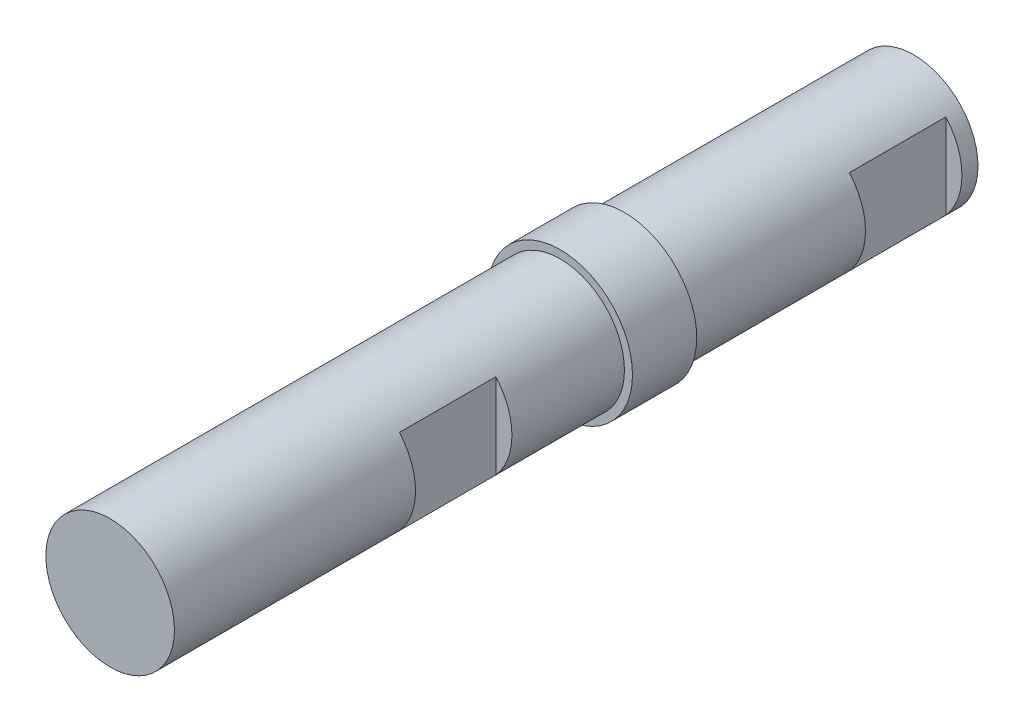
ISO-10303-21;
HEADER;
FILE_DESCRIPTION(('STEP AP214'),'2;1');
FILE_NAME('part.step','',(''),(''),'','','');
FILE_SCHEMA(('AUTOMOTIVE_DESIGN { 1 0 10303 214 1 1 1 1 }'));
ENDSEC;
DATA;
#1=APPLICATION_CONTEXT('core data for automotive mechanical design processes');
#2=APPLICATION_PROTOCOL_DEFINITION('international standard','automotive_design',2000,#1);
#3=PRODUCT_CONTEXT('',#1,'mechanical');
#4=PRODUCT('Part','Part','',(#3));
#5=PRODUCT_RELATED_PRODUCT_CATEGORY('part','',(#4));
#6=PRODUCT_DEFINITION_FORMATION('','',#4);
#7=PRODUCT_DEFINITION_CONTEXT('part definition',#1,'design');
#8=PRODUCT_DEFINITION('design','',#6,#7);
#9=PRODUCT_DEFINITION_SHAPE('','',#8);
#10=(LENGTH_UNIT() NAMED_UNIT(*) SI_UNIT(.MILLI.,.METRE.));
#11=(NAMED_UNIT(*) PLANE_ANGLE_UNIT() SI_UNIT($,.RADIAN.));
#12=(NAMED_UNIT(*) SI_UNIT($,.STERADIAN.) SOLID_ANGLE_UNIT());
#13=UNCERTAINTY_MEASURE_WITH_UNIT(LENGTH_MEASURE(1.E-05),#10,'distance_accuracy_value','');
#14=(GEOMETRIC_REPRESENTATION_CONTEXT(3) GLOBAL_UNCERTAINTY_ASSIGNED_CONTEXT((#13)) GLOBAL_UNIT_ASSIGNED_CONTEXT((#10,
#11,#12)) REPRESENTATION_CONTEXT('',''));
#15=CARTESIAN_POINT('',(0.,0.,0.));
#16=DIRECTION('',(0.,0.,1.));
#17=DIRECTION('',(1.,0.,0.));
#18=AXIS2_PLACEMENT_3D('',#15,#16,#17);
#19=CARTESIAN_POINT('',(0.,0.,50.));
#20=DIRECTION('',(0.,0.,-1.));
#21=DIRECTION('',(-1.,0.,0.));
#22=AXIS2_PLACEMENT_3D('',#19,#20,#21);
#23=CYLINDRICAL_SURFACE('',#22,4.);
#24=CARTESIAN_POINT('',(0.,0.,35.));
#25=DIRECTION('',(0.,0.,1.));
#26=DIRECTION('',(1.,0.,0.));
#27=AXIS2_PLACEMENT_3D('',#24,#25,#26);
#28=CIRCLE('',#27,4.);
#29=CARTESIAN_POINT('',(3.,-2.64575131106459,35.));
#30=VERTEX_POINT('',#29);
#31=CARTESIAN_POINT('',(3.,2.64575131106459,35.));
#32=VERTEX_POINT('',#31);
#33=EDGE_CURVE('E94',#30,#32,#28,.T.);
#34=ORIENTED_EDGE('',*,*,#33,.T.);
#35=DIRECTION('',(0.,0.,-1.));
#36=VECTOR('',#35,1.);
#37=CARTESIAN_POINT('',(3.,2.64575131106459,50.));
#38=LINE('',#37,#36);
#39=CARTESIAN_POINT('',(3.,2.64575131106459,29.));
#40=VERTEX_POINT('',#39);
#41=EDGE_CURVE('E87',#40,#32,#38,.F.);
#42=ORIENTED_EDGE('',*,*,#41,.F.);
#43=CARTESIAN_POINT('',(0.,0.,29.));
#44=DIRECTION('',(0.,0.,-1.));
#45=DIRECTION('',(0.,1.,0.));
#46=AXIS2_PLACEMENT_3D('',#43,#44,#45);
#47=CIRCLE('',#46,4.);
#48=CARTESIAN_POINT('',(3.,-2.64575131106459,29.));
#49=VERTEX_POINT('',#48);
#50=EDGE_CURVE('E53',#40,#49,#47,.T.);
#51=ORIENTED_EDGE('',*,*,#50,.T.);
#52=DIRECTION('',(0.,0.,-1.));
#53=VECTOR('',#52,1.);
#54=CARTESIAN_POINT('',(3.,-2.64575131106459,50.));
#55=LINE('',#54,#53);
#56=EDGE_CURVE('E92',#30,#49,#55,.T.);
#57=ORIENTED_EDGE('',*,*,#56,.F.);
#58=EDGE_LOOP('',(#34,#42,#51,#57));
#59=FACE_BOUND('',#58,.T.);
#60=CARTESIAN_POINT('',(0.,0.,22.));
#61=DIRECTION('',(0.,0.,1.));
#62=DIRECTION('',(1.,0.,0.));
#63=AXIS2_PLACEMENT_3D('',#60,#61,#62);
#64=CIRCLE('',#63,4.);
#65=CARTESIAN_POINT('',(4.,0.,22.));
#66=VERTEX_POINT('',#65);
#67=EDGE_CURVE('E110',#66,#66,#64,.T.);
#68=ORIENTED_EDGE('',*,*,#67,.T.);
#69=EDGE_LOOP('',(#68));
#70=FACE_BOUND('',#69,.T.);
#71=CARTESIAN_POINT('',(0.,0.,50.));
#72=DIRECTION('',(0.,0.,1.));
#73=DIRECTION('',(1.,0.,0.));
#74=AXIS2_PLACEMENT_3D('',#71,#72,#73);
#75=CIRCLE('',#74,4.);
#76=CARTESIAN_POINT('',(4.,0.,50.));
#77=VERTEX_POINT('',#76);
#78=EDGE_CURVE('E107',#77,#77,#75,.T.);
#79=ORIENTED_EDGE('',*,*,#78,.F.);
#80=EDGE_LOOP('',(#79));
#81=FACE_BOUND('',#80,.T.);
#82=ADVANCED_FACE('F32',(#59,#70,#81),#23,.T.);
#83=CARTESIAN_POINT('',(0.,0.,18.));
#84=DIRECTION('',(0.,0.,-1.));
#85=DIRECTION('',(-1.,0.,0.));
#86=AXIS2_PLACEMENT_3D('',#83,#84,#85);
#87=CYLINDRICAL_SURFACE('',#86,4.);
#88=DIRECTION('',(0.,0.,-1.));
#89=VECTOR('',#88,1.);
#90=CARTESIAN_POINT('',(3.,2.64575131106459,18.));
#91=LINE('',#90,#89);
#92=CARTESIAN_POINT('',(3.,2.64575131106459,7.));
#93=VERTEX_POINT('',#92);
#94=CARTESIAN_POINT('',(3.,2.64575131106459,1.));
#95=VERTEX_POINT('',#94);
#96=EDGE_CURVE('E11',#93,#95,#91,.T.);
#97=ORIENTED_EDGE('',*,*,#96,.T.);
#98=CARTESIAN_POINT('',(0.,0.,1.));
#99=DIRECTION('',(0.,0.,-1.));
#100=DIRECTION('',(0.,1.,0.));
#101=AXIS2_PLACEMENT_3D('',#98,#99,#100);
#102=CIRCLE('',#101,4.);
#103=CARTESIAN_POINT('',(3.,-2.64575131106459,1.));
#104=VERTEX_POINT('',#103);
#105=EDGE_CURVE('E81',#95,#104,#102,.T.);
#106=ORIENTED_EDGE('',*,*,#105,.T.);
#107=DIRECTION('',(0.,0.,-1.));
#108=VECTOR('',#107,1.);
#109=CARTESIAN_POINT('',(3.,-2.64575131106459,18.));
#110=LINE('',#109,#108);
#111=CARTESIAN_POINT('',(3.,-2.64575131106459,7.));
#112=VERTEX_POINT('',#111);
#113=EDGE_CURVE('E40',#104,#112,#110,.F.);
#114=ORIENTED_EDGE('',*,*,#113,.T.);
#115=CARTESIAN_POINT('',(0.,0.,7.));
#116=DIRECTION('',(0.,0.,1.));
#117=DIRECTION('',(0.,-1.,0.));
#118=AXIS2_PLACEMENT_3D('',#115,#116,#117);
#119=CIRCLE('',#118,4.);
#120=EDGE_CURVE('E46',#112,#93,#119,.T.);
#121=ORIENTED_EDGE('',*,*,#120,.T.);
#122=EDGE_LOOP('',(#97,#106,#114,#121));
#123=FACE_BOUND('',#122,.T.);
#124=CARTESIAN_POINT('',(0.,0.,18.));
#125=DIRECTION('',(0.,0.,1.));
#126=DIRECTION('',(1.,0.,0.));
#127=AXIS2_PLACEMENT_3D('',#124,#125,#126);
#128=CIRCLE('',#127,4.);
#129=CARTESIAN_POINT('',(4.,0.,18.));
#130=VERTEX_POINT('',#129);
#131=EDGE_CURVE('E97',#130,#130,#128,.T.);
#132=ORIENTED_EDGE('',*,*,#131,.F.);
#133=EDGE_LOOP('',(#132));
#134=FACE_BOUND('',#133,.T.);
#135=CARTESIAN_POINT('',(0.,0.,0.));
#136=DIRECTION('',(0.,0.,1.));
#137=DIRECTION('',(1.,0.,0.));
#138=AXIS2_PLACEMENT_3D('',#135,#136,#137);
#139=CIRCLE('',#138,4.);
#140=CARTESIAN_POINT('',(4.,0.,0.));
#141=VERTEX_POINT('',#140);
#142=EDGE_CURVE('E98',#141,#141,#139,.T.);
#143=ORIENTED_EDGE('',*,*,#142,.T.);
#144=EDGE_LOOP('',(#143));
#145=FACE_BOUND('',#144,.T.);
#146=ADVANCED_FACE('F34',(#123,#134,#145),#87,.T.);
#147=CARTESIAN_POINT('',(0.,0.,0.));
#148=DIRECTION('',(0.,0.,1.));
#149=DIRECTION('',(1.,0.,0.));
#150=AXIS2_PLACEMENT_3D('',#147,#148,#149);
#151=PLANE('',#150);
#152=ORIENTED_EDGE('',*,*,#142,.F.);
#153=EDGE_LOOP('',(#152));
#154=FACE_BOUND('',#153,.T.);
#155=ADVANCED_FACE('F146',(#154),#151,.F.);
#156=CARTESIAN_POINT('',(0.,0.,22.));
#157=DIRECTION('',(0.,0.,-1.));
#158=DIRECTION('',(-1.,0.,0.));
#159=AXIS2_PLACEMENT_3D('',#156,#157,#158);
#160=CYLINDRICAL_SURFACE('',#159,4.5);
#161=CARTESIAN_POINT('',(0.,0.,22.));
#162=DIRECTION('',(0.,0.,1.));
#163=DIRECTION('',(1.,0.,0.));
#164=AXIS2_PLACEMENT_3D('',#161,#162,#163);
#165=CIRCLE('',#164,4.5);
#166=CARTESIAN_POINT('',(4.5,0.,22.));
#167=VERTEX_POINT('',#166);
#168=EDGE_CURVE('E101',#167,#167,#165,.T.);
#169=ORIENTED_EDGE('',*,*,#168,.F.);
#170=EDGE_LOOP('',(#169));
#171=FACE_BOUND('',#170,.T.);
#172=CARTESIAN_POINT('',(0.,0.,18.));
#173=DIRECTION('',(0.,0.,1.));
#174=DIRECTION('',(1.,0.,0.));
#175=AXIS2_PLACEMENT_3D('',#172,#173,#174);
#176=CIRCLE('',#175,4.5);
#177=CARTESIAN_POINT('',(4.5,0.,18.));
#178=VERTEX_POINT('',#177);
#179=EDGE_CURVE('E104',#178,#178,#176,.T.);
#180=ORIENTED_EDGE('',*,*,#179,.T.);
#181=EDGE_LOOP('',(#180));
#182=FACE_BOUND('',#181,.T.);
#183=ADVANCED_FACE('F151',(#171,#182),#160,.T.);
#184=CARTESIAN_POINT('',(0.,0.,22.));
#185=DIRECTION('',(0.,0.,1.));
#186=DIRECTION('',(1.,0.,0.));
#187=AXIS2_PLACEMENT_3D('',#184,#185,#186);
#188=PLANE('',#187);
#189=ORIENTED_EDGE('',*,*,#67,.F.);
#190=EDGE_LOOP('',(#189));
#191=FACE_BOUND('',#190,.T.);
#192=ORIENTED_EDGE('',*,*,#168,.T.);
#193=EDGE_LOOP('',(#192));
#194=FACE_BOUND('',#193,.T.);
#195=ADVANCED_FACE('F148',(#191,#194),#188,.T.);
#196=CARTESIAN_POINT('',(0.,0.,18.));
#197=DIRECTION('',(0.,0.,1.));
#198=DIRECTION('',(1.,0.,0.));
#199=AXIS2_PLACEMENT_3D('',#196,#197,#198);
#200=PLANE('',#199);
#201=ORIENTED_EDGE('',*,*,#131,.T.);
#202=EDGE_LOOP('',(#201));
#203=FACE_BOUND('',#202,.T.);
#204=ORIENTED_EDGE('',*,*,#179,.F.);
#205=EDGE_LOOP('',(#204));
#206=FACE_BOUND('',#205,.T.);
#207=ADVANCED_FACE('F138',(#203,#206),#200,.F.);
#208=CARTESIAN_POINT('',(0.,0.,50.));
#209=DIRECTION('',(0.,0.,1.));
#210=DIRECTION('',(1.,0.,0.));
#211=AXIS2_PLACEMENT_3D('',#208,#209,#210);
#212=PLANE('',#211);
#213=ORIENTED_EDGE('',*,*,#78,.T.);
#214=EDGE_LOOP('',(#213));
#215=FACE_BOUND('',#214,.T.);
#216=ADVANCED_FACE('F131',(#215),#212,.T.);
#217=CARTESIAN_POINT('',(3.,3.,35.));
#218=DIRECTION('',(0.,0.,1.));
#219=DIRECTION('',(1.,0.,0.));
#220=AXIS2_PLACEMENT_3D('',#217,#218,#219);
#221=PLANE('',#220);
#222=ORIENTED_EDGE('',*,*,#33,.F.);
#223=DIRECTION('',(0.,-1.,0.));
#224=VECTOR('',#223,1.);
#225=CARTESIAN_POINT('',(3.,3.,35.));
#226=LINE('',#225,#224);
#227=EDGE_CURVE('E117',#32,#30,#226,.T.);
#228=ORIENTED_EDGE('',*,*,#227,.F.);
#229=EDGE_LOOP('',(#222,#228));
#230=FACE_BOUND('',#229,.T.);
#231=ADVANCED_FACE('F128',(#230),#221,.F.);
#232=CARTESIAN_POINT('',(3.,3.,29.));
#233=DIRECTION('',(0.,0.,-1.));
#234=DIRECTION('',(0.,1.,0.));
#235=AXIS2_PLACEMENT_3D('',#232,#233,#234);
#236=PLANE('',#235);
#237=DIRECTION('',(0.,1.,0.));
#238=VECTOR('',#237,1.);
#239=CARTESIAN_POINT('',(3.,3.,29.));
#240=LINE('',#239,#238);
#241=EDGE_CURVE('E113',#49,#40,#240,.T.);
#242=ORIENTED_EDGE('',*,*,#241,.F.);
#243=ORIENTED_EDGE('',*,*,#50,.F.);
#244=EDGE_LOOP('',(#242,#243));
#245=FACE_BOUND('',#244,.T.);
#246=ADVANCED_FACE('F130',(#245),#236,.F.);
#247=CARTESIAN_POINT('',(3.,0.,0.));
#248=DIRECTION('',(1.,0.,0.));
#249=DIRECTION('',(0.,0.,-1.));
#250=AXIS2_PLACEMENT_3D('',#247,#248,#249);
#251=PLANE('',#250);
#252=ORIENTED_EDGE('',*,*,#56,.T.);
#253=ORIENTED_EDGE('',*,*,#241,.T.);
#254=ORIENTED_EDGE('',*,*,#41,.T.);
#255=ORIENTED_EDGE('',*,*,#227,.T.);
#256=EDGE_LOOP('',(#252,#253,#254,#255));
#257=FACE_BOUND('',#256,.T.);
#258=ADVANCED_FACE('F123',(#257),#251,.T.);
#259=CARTESIAN_POINT('',(3.,3.,1.));
#260=DIRECTION('',(0.,0.,-1.));
#261=DIRECTION('',(0.,1.,0.));
#262=AXIS2_PLACEMENT_3D('',#259,#260,#261);
#263=PLANE('',#262);
#264=DIRECTION('',(0.,1.,0.));
#265=VECTOR('',#264,1.);
#266=CARTESIAN_POINT('',(3.,3.,1.));
#267=LINE('',#266,#265);
#268=EDGE_CURVE('E77',#104,#95,#267,.T.);
#269=ORIENTED_EDGE('',*,*,#268,.F.);
#270=ORIENTED_EDGE('',*,*,#105,.F.);
#271=EDGE_LOOP('',(#269,#270));
#272=FACE_BOUND('',#271,.T.);
#273=ADVANCED_FACE('F83',(#272),#263,.F.);
#274=CARTESIAN_POINT('',(3.,3.,7.));
#275=DIRECTION('',(0.,0.,1.));
#276=DIRECTION('',(0.,-1.,0.));
#277=AXIS2_PLACEMENT_3D('',#274,#275,#276);
#278=PLANE('',#277);
#279=DIRECTION('',(0.,-1.,0.));
#280=VECTOR('',#279,1.);
#281=CARTESIAN_POINT('',(3.,3.,7.));
#282=LINE('',#281,#280);
#283=EDGE_CURVE('E78',#93,#112,#282,.T.);
#284=ORIENTED_EDGE('',*,*,#283,.F.);
#285=ORIENTED_EDGE('',*,*,#120,.F.);
#286=EDGE_LOOP('',(#284,#285));
#287=FACE_BOUND('',#286,.T.);
#288=ADVANCED_FACE('F217',(#287),#278,.F.);
#289=CARTESIAN_POINT('',(3.,0.,0.));
#290=DIRECTION('',(-1.,0.,0.));
#291=DIRECTION('',(0.,0.,1.));
#292=AXIS2_PLACEMENT_3D('',#289,#290,#291);
#293=PLANE('',#292);
#294=ORIENTED_EDGE('',*,*,#283,.T.);
#295=ORIENTED_EDGE('',*,*,#113,.F.);
#296=ORIENTED_EDGE('',*,*,#268,.T.);
#297=ORIENTED_EDGE('',*,*,#96,.F.);
#298=EDGE_LOOP('',(#294,#295,#296,#297));
#299=FACE_BOUND('',#298,.T.);
#300=ADVANCED_FACE('F76',(#299),#293,.F.);
#301=CLOSED_SHELL('',(#82,#146,#155,#183,#195,#207,#216,#231,#246,#258,#273,#288,#300));
#302=MANIFOLD_SOLID_BREP('B2',#301);
#303=ADVANCED_BREP_SHAPE_REPRESENTATION('',(#18,#302),#14);
#304=SHAPE_DEFINITION_REPRESENTATION(#9,#303);
ENDSEC;
END-ISO-10303-21;
